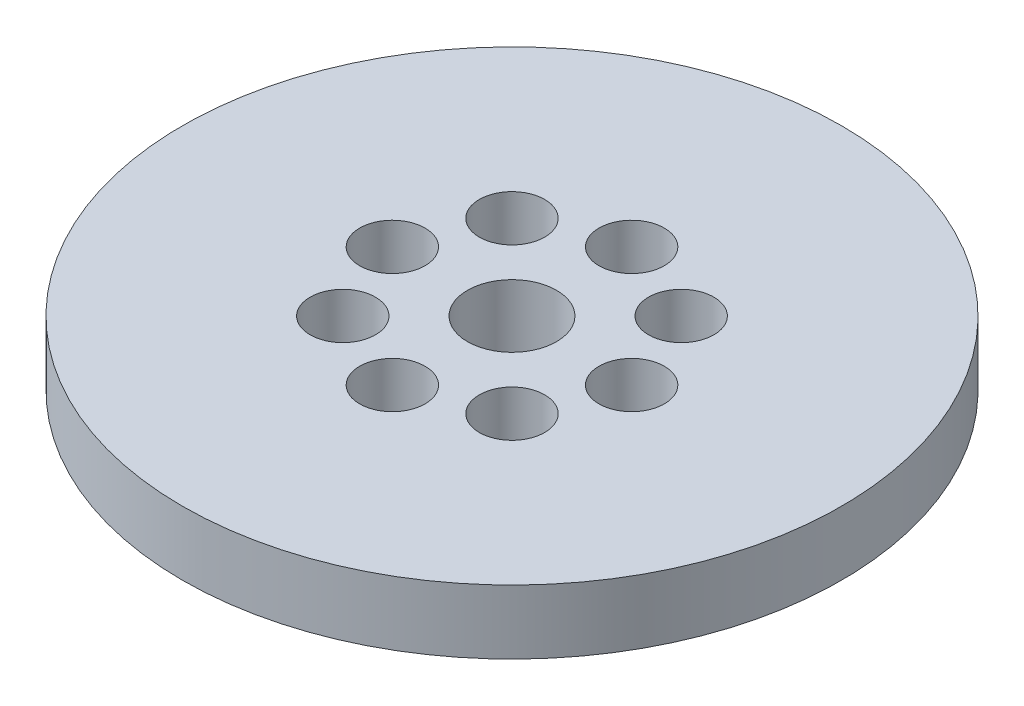
ISO-10303-21;
HEADER;
FILE_DESCRIPTION(('STEP AP214'),'2;1');
FILE_NAME('part.step','',(''),(''),'','','');
FILE_SCHEMA(('AUTOMOTIVE_DESIGN { 1 0 10303 214 1 1 1 1 }'));
ENDSEC;
DATA;
#1=APPLICATION_CONTEXT('core data for automotive mechanical design processes');
#2=APPLICATION_PROTOCOL_DEFINITION('international standard','automotive_design',2000,#1);
#3=PRODUCT_CONTEXT('',#1,'mechanical');
#4=PRODUCT('Part','Part','',(#3));
#5=PRODUCT_RELATED_PRODUCT_CATEGORY('part','',(#4));
#6=PRODUCT_DEFINITION_FORMATION('','',#4);
#7=PRODUCT_DEFINITION_CONTEXT('part definition',#1,'design');
#8=PRODUCT_DEFINITION('design','',#6,#7);
#9=PRODUCT_DEFINITION_SHAPE('','',#8);
#10=(LENGTH_UNIT() NAMED_UNIT(*) SI_UNIT(.MILLI.,.METRE.));
#11=(NAMED_UNIT(*) PLANE_ANGLE_UNIT() SI_UNIT($,.RADIAN.));
#12=(NAMED_UNIT(*) SI_UNIT($,.STERADIAN.) SOLID_ANGLE_UNIT());
#13=UNCERTAINTY_MEASURE_WITH_UNIT(LENGTH_MEASURE(1.E-05),#10,'distance_accuracy_value','');
#14=(GEOMETRIC_REPRESENTATION_CONTEXT(3) GLOBAL_UNCERTAINTY_ASSIGNED_CONTEXT((#13)) GLOBAL_UNIT_ASSIGNED_CONTEXT((#10,
#11,#12)) REPRESENTATION_CONTEXT('',''));
#15=CARTESIAN_POINT('',(0.,0.,0.));
#16=DIRECTION('',(0.,0.,1.));
#17=DIRECTION('',(1.,0.,0.));
#18=AXIS2_PLACEMENT_3D('',#15,#16,#17);
#19=CARTESIAN_POINT('',(0.,18.,0.));
#20=DIRECTION('',(0.,-1.,0.));
#21=DIRECTION('',(0.,0.,-1.));
#22=AXIS2_PLACEMENT_3D('',#19,#20,#21);
#23=CYLINDRICAL_SURFACE('',#22,92.5);
#24=CARTESIAN_POINT('',(0.,18.,0.));
#25=DIRECTION('',(0.,1.,0.));
#26=DIRECTION('',(0.,0.,1.));
#27=AXIS2_PLACEMENT_3D('',#24,#25,#26);
#28=CIRCLE('',#27,92.5);
#29=CARTESIAN_POINT('',(0.,18.,92.5));
#30=VERTEX_POINT('',#29);
#31=EDGE_CURVE('E10',#30,#30,#28,.T.);
#32=ORIENTED_EDGE('',*,*,#31,.F.);
#33=EDGE_LOOP('',(#32));
#34=FACE_BOUND('',#33,.T.);
#35=CARTESIAN_POINT('',(0.,0.,0.));
#36=DIRECTION('',(0.,1.,0.));
#37=DIRECTION('',(0.,0.,1.));
#38=AXIS2_PLACEMENT_3D('',#35,#36,#37);
#39=CIRCLE('',#38,92.5);
#40=CARTESIAN_POINT('',(0.,0.,92.5));
#41=VERTEX_POINT('',#40);
#42=EDGE_CURVE('E37',#41,#41,#39,.T.);
#43=ORIENTED_EDGE('',*,*,#42,.T.);
#44=EDGE_LOOP('',(#43));
#45=FACE_BOUND('',#44,.T.);
#46=ADVANCED_FACE('F40',(#34,#45),#23,.T.);
#47=CARTESIAN_POINT('',(0.,18.,0.));
#48=DIRECTION('',(0.,1.,0.));
#49=DIRECTION('',(0.,0.,1.));
#50=AXIS2_PLACEMENT_3D('',#47,#48,#49);
#51=PLANE('',#50);
#52=CARTESIAN_POINT('',(1.17248747538768E-13,18.,33.5813759719584));
#53=DIRECTION('',(0.,1.,0.));
#54=DIRECTION('',(1.,0.,0.));
#55=AXIS2_PLACEMENT_3D('',#52,#53,#54);
#56=CIRCLE('',#55,9.17293482669235);
#57=CARTESIAN_POINT('',(9.17293482669247,18.,33.5813759719584));
#58=VERTEX_POINT('',#57);
#59=EDGE_CURVE('E88',#58,#58,#56,.T.);
#60=ORIENTED_EDGE('',*,*,#59,.F.);
#61=EDGE_LOOP('',(#60));
#62=FACE_BOUND('',#61,.T.);
#63=CARTESIAN_POINT('',(23.7456186713469,18.,23.7456186713467));
#64=DIRECTION('',(0.,1.,0.));
#65=DIRECTION('',(0.707106781186544,0.,-0.707106781186551));
#66=AXIS2_PLACEMENT_3D('',#63,#64,#65);
#67=CIRCLE('',#66,9.17293482669235);
#68=CARTESIAN_POINT('',(30.2318630906833,18.,17.2593742520102));
#69=VERTEX_POINT('',#68);
#70=EDGE_CURVE('E79',#69,#69,#67,.T.);
#71=ORIENTED_EDGE('',*,*,#70,.F.);
#72=EDGE_LOOP('',(#71));
#73=FACE_BOUND('',#72,.T.);
#74=CARTESIAN_POINT('',(33.5813759719584,18.,0.));
#75=DIRECTION('',(0.,1.,0.));
#76=DIRECTION('',(0.,0.,-1.));
#77=AXIS2_PLACEMENT_3D('',#74,#75,#76);
#78=CIRCLE('',#77,9.17293482669235);
#79=CARTESIAN_POINT('',(33.5813759719584,18.,-9.17293482669235));
#80=VERTEX_POINT('',#79);
#81=EDGE_CURVE('E74',#80,#80,#78,.T.);
#82=ORIENTED_EDGE('',*,*,#81,.F.);
#83=EDGE_LOOP('',(#82));
#84=FACE_BOUND('',#83,.T.);
#85=CARTESIAN_POINT('',(23.7456186713466,18.,-23.745618671347));
#86=DIRECTION('',(0.,1.,0.));
#87=DIRECTION('',(-0.707106781186554,0.,-0.707106781186541));
#88=AXIS2_PLACEMENT_3D('',#85,#86,#87);
#89=CIRCLE('',#88,9.17293482669235);
#90=CARTESIAN_POINT('',(17.2593742520101,18.,-30.2318630906834));
#91=VERTEX_POINT('',#90);
#92=EDGE_CURVE('E70',#91,#91,#89,.T.);
#93=ORIENTED_EDGE('',*,*,#92,.F.);
#94=EDGE_LOOP('',(#93));
#95=FACE_BOUND('',#94,.T.);
#96=CARTESIAN_POINT('',(-3.51746242616304E-13,18.,-33.5813759719584));
#97=DIRECTION('',(0.,1.,0.));
#98=DIRECTION('',(-1.,0.,0.));
#99=AXIS2_PLACEMENT_3D('',#96,#97,#98);
#100=CIRCLE('',#99,9.17293482669235);
#101=CARTESIAN_POINT('',(-9.1729348266927,18.,-33.5813759719583));
#102=VERTEX_POINT('',#101);
#103=EDGE_CURVE('E100',#102,#102,#100,.T.);
#104=ORIENTED_EDGE('',*,*,#103,.F.);
#105=EDGE_LOOP('',(#104));
#106=FACE_BOUND('',#105,.T.);
#107=CARTESIAN_POINT('',(-23.7456186713471,18.,-23.7456186713465));
#108=DIRECTION('',(0.,1.,0.));
#109=DIRECTION('',(-0.707106781186539,0.,0.707106781186556));
#110=AXIS2_PLACEMENT_3D('',#107,#108,#109);
#111=CIRCLE('',#110,9.17293482669235);
#112=CARTESIAN_POINT('',(-30.2318630906834,18.,-17.25937425201));
#113=VERTEX_POINT('',#112);
#114=EDGE_CURVE('E93',#113,#113,#111,.T.);
#115=ORIENTED_EDGE('',*,*,#114,.F.);
#116=EDGE_LOOP('',(#115));
#117=FACE_BOUND('',#116,.T.);
#118=CARTESIAN_POINT('',(-23.7456186713468,18.,23.7456186713468));
#119=DIRECTION('',(0.,1.,0.));
#120=DIRECTION('',(0.707106781186549,0.,0.707106781186546));
#121=AXIS2_PLACEMENT_3D('',#118,#119,#120);
#122=CIRCLE('',#121,9.17293482669235);
#123=CARTESIAN_POINT('',(-17.2593742520103,18.,30.2318630906832));
#124=VERTEX_POINT('',#123);
#125=EDGE_CURVE('E61',#124,#124,#122,.T.);
#126=ORIENTED_EDGE('',*,*,#125,.F.);
#127=EDGE_LOOP('',(#126));
#128=FACE_BOUND('',#127,.T.);
#129=CARTESIAN_POINT('',(-33.5813759719584,18.,0.));
#130=DIRECTION('',(0.,1.,0.));
#131=DIRECTION('',(0.,0.,1.));
#132=AXIS2_PLACEMENT_3D('',#129,#130,#131);
#133=CIRCLE('',#132,9.17293482669235);
#134=CARTESIAN_POINT('',(-33.5813759719584,18.,9.17293482669235));
#135=VERTEX_POINT('',#134);
#136=EDGE_CURVE('E54',#135,#135,#133,.T.);
#137=ORIENTED_EDGE('',*,*,#136,.F.);
#138=EDGE_LOOP('',(#137));
#139=FACE_BOUND('',#138,.T.);
#140=CARTESIAN_POINT('',(0.,18.,0.));
#141=DIRECTION('',(0.,1.,0.));
#142=DIRECTION('',(0.,0.,1.));
#143=AXIS2_PLACEMENT_3D('',#140,#141,#142);
#144=CIRCLE('',#143,12.5);
#145=CARTESIAN_POINT('',(0.,18.,12.5));
#146=VERTEX_POINT('',#145);
#147=EDGE_CURVE('E50',#146,#146,#144,.T.);
#148=ORIENTED_EDGE('',*,*,#147,.F.);
#149=EDGE_LOOP('',(#148));
#150=FACE_BOUND('',#149,.T.);
#151=ORIENTED_EDGE('',*,*,#31,.T.);
#152=EDGE_LOOP('',(#151));
#153=FACE_BOUND('',#152,.T.);
#154=ADVANCED_FACE('F115',(#62,#73,#84,#95,#106,#117,#128,#139,#150,#153),#51,.T.);
#155=CARTESIAN_POINT('',(0.,0.,0.));
#156=DIRECTION('',(0.,1.,0.));
#157=DIRECTION('',(0.,0.,1.));
#158=AXIS2_PLACEMENT_3D('',#155,#156,#157);
#159=PLANE('',#158);
#160=CARTESIAN_POINT('',(0.,0.,0.));
#161=DIRECTION('',(0.,1.,0.));
#162=DIRECTION('',(0.,0.,1.));
#163=AXIS2_PLACEMENT_3D('',#160,#161,#162);
#164=CIRCLE('',#163,12.5);
#165=CARTESIAN_POINT('',(0.,0.,12.5));
#166=VERTEX_POINT('',#165);
#167=EDGE_CURVE('E47',#166,#166,#164,.T.);
#168=ORIENTED_EDGE('',*,*,#167,.T.);
#169=EDGE_LOOP('',(#168));
#170=FACE_BOUND('',#169,.T.);
#171=ORIENTED_EDGE('',*,*,#42,.F.);
#172=EDGE_LOOP('',(#171));
#173=FACE_BOUND('',#172,.T.);
#174=ADVANCED_FACE('F113',(#170,#173),#159,.F.);
#175=CARTESIAN_POINT('',(0.,18.,0.));
#176=DIRECTION('',(0.,-1.,0.));
#177=DIRECTION('',(0.,0.,-1.));
#178=AXIS2_PLACEMENT_3D('',#175,#176,#177);
#179=CYLINDRICAL_SURFACE('',#178,12.5);
#180=ORIENTED_EDGE('',*,*,#147,.T.);
#181=EDGE_LOOP('',(#180));
#182=FACE_BOUND('',#181,.T.);
#183=ORIENTED_EDGE('',*,*,#167,.F.);
#184=EDGE_LOOP('',(#183));
#185=FACE_BOUND('',#184,.T.);
#186=ADVANCED_FACE('F127',(#182,#185),#179,.F.);
#187=CARTESIAN_POINT('',(-33.5813759719584,0.478809629029006,0.));
#188=DIRECTION('',(0.,1.,0.));
#189=DIRECTION('',(0.,0.,1.));
#190=AXIS2_PLACEMENT_3D('',#187,#188,#189);
#191=CYLINDRICAL_SURFACE('',#190,9.17293482669235);
#192=CARTESIAN_POINT('',(-33.5813759719584,0.478809629029006,0.));
#193=DIRECTION('',(0.,1.,0.));
#194=DIRECTION('',(0.,0.,1.));
#195=AXIS2_PLACEMENT_3D('',#192,#193,#194);
#196=CIRCLE('',#195,9.17293482669235);
#197=CARTESIAN_POINT('',(-33.5813759719584,0.478809629029006,9.17293482669235));
#198=VERTEX_POINT('',#197);
#199=EDGE_CURVE('E55',#198,#198,#196,.T.);
#200=ORIENTED_EDGE('',*,*,#199,.F.);
#201=EDGE_LOOP('',(#200));
#202=FACE_BOUND('',#201,.T.);
#203=ORIENTED_EDGE('',*,*,#136,.T.);
#204=EDGE_LOOP('',(#203));
#205=FACE_BOUND('',#204,.T.);
#206=ADVANCED_FACE('F129',(#202,#205),#191,.F.);
#207=CARTESIAN_POINT('',(-33.5813759719584,0.478809629029006,0.));
#208=DIRECTION('',(0.,1.,0.));
#209=DIRECTION('',(0.,0.,1.));
#210=AXIS2_PLACEMENT_3D('',#207,#208,#209);
#211=PLANE('',#210);
#212=ORIENTED_EDGE('',*,*,#199,.T.);
#213=EDGE_LOOP('',(#212));
#214=FACE_BOUND('',#213,.T.);
#215=ADVANCED_FACE('F157',(#214),#211,.T.);
#216=CARTESIAN_POINT('',(-23.7456186713468,0.478809629029006,23.7456186713468));
#217=DIRECTION('',(0.,1.,0.));
#218=DIRECTION('',(0.,0.,1.));
#219=AXIS2_PLACEMENT_3D('',#216,#217,#218);
#220=CYLINDRICAL_SURFACE('',#219,9.17293482669235);
#221=CARTESIAN_POINT('',(-23.7456186713468,0.478809629029006,23.7456186713468));
#222=DIRECTION('',(0.,1.,0.));
#223=DIRECTION('',(0.707106781186549,0.,0.707106781186546));
#224=AXIS2_PLACEMENT_3D('',#221,#222,#223);
#225=CIRCLE('',#224,9.17293482669235);
#226=CARTESIAN_POINT('',(-17.2593742520103,0.478809629029006,30.2318630906832));
#227=VERTEX_POINT('',#226);
#228=EDGE_CURVE('E59',#227,#227,#225,.T.);
#229=ORIENTED_EDGE('',*,*,#228,.F.);
#230=EDGE_LOOP('',(#229));
#231=FACE_BOUND('',#230,.T.);
#232=ORIENTED_EDGE('',*,*,#125,.T.);
#233=EDGE_LOOP('',(#232));
#234=FACE_BOUND('',#233,.T.);
#235=ADVANCED_FACE('F170',(#231,#234),#220,.F.);
#236=CARTESIAN_POINT('',(-23.7456186713468,0.478809629029006,23.7456186713468));
#237=DIRECTION('',(0.,1.,0.));
#238=DIRECTION('',(0.707106781186549,0.,0.707106781186546));
#239=AXIS2_PLACEMENT_3D('',#236,#237,#238);
#240=PLANE('',#239);
#241=ORIENTED_EDGE('',*,*,#228,.T.);
#242=EDGE_LOOP('',(#241));
#243=FACE_BOUND('',#242,.T.);
#244=ADVANCED_FACE('F182',(#243),#240,.T.);
#245=CARTESIAN_POINT('',(-23.7456186713471,0.478809629029006,-23.7456186713465));
#246=DIRECTION('',(0.,1.,0.));
#247=DIRECTION('',(0.,0.,1.));
#248=AXIS2_PLACEMENT_3D('',#245,#246,#247);
#249=CYLINDRICAL_SURFACE('',#248,9.17293482669235);
#250=CARTESIAN_POINT('',(-23.7456186713471,0.478809629029006,-23.7456186713465));
#251=DIRECTION('',(0.,1.,0.));
#252=DIRECTION('',(-0.707106781186539,0.,0.707106781186556));
#253=AXIS2_PLACEMENT_3D('',#250,#251,#252);
#254=CIRCLE('',#253,9.17293482669235);
#255=CARTESIAN_POINT('',(-30.2318630906834,0.478809629029006,-17.25937425201));
#256=VERTEX_POINT('',#255);
#257=EDGE_CURVE('E94',#256,#256,#254,.T.);
#258=ORIENTED_EDGE('',*,*,#257,.F.);
#259=EDGE_LOOP('',(#258));
#260=FACE_BOUND('',#259,.T.);
#261=ORIENTED_EDGE('',*,*,#114,.T.);
#262=EDGE_LOOP('',(#261));
#263=FACE_BOUND('',#262,.T.);
#264=ADVANCED_FACE('F189',(#260,#263),#249,.F.);
#265=CARTESIAN_POINT('',(-23.7456186713471,0.478809629029006,-23.7456186713465));
#266=DIRECTION('',(0.,1.,0.));
#267=DIRECTION('',(-0.707106781186539,0.,0.707106781186556));
#268=AXIS2_PLACEMENT_3D('',#265,#266,#267);
#269=PLANE('',#268);
#270=ORIENTED_EDGE('',*,*,#257,.T.);
#271=EDGE_LOOP('',(#270));
#272=FACE_BOUND('',#271,.T.);
#273=ADVANCED_FACE('F107',(#272),#269,.T.);
#274=CARTESIAN_POINT('',(-3.51746242616304E-13,0.478809629029006,-33.5813759719584));
#275=DIRECTION('',(0.,1.,0.));
#276=DIRECTION('',(0.,0.,1.));
#277=AXIS2_PLACEMENT_3D('',#274,#275,#276);
#278=CYLINDRICAL_SURFACE('',#277,9.17293482669235);
#279=CARTESIAN_POINT('',(-3.51746242616304E-13,0.478809629029006,-33.5813759719584));
#280=DIRECTION('',(0.,1.,0.));
#281=DIRECTION('',(-1.,0.,0.));
#282=AXIS2_PLACEMENT_3D('',#279,#280,#281);
#283=CIRCLE('',#282,9.17293482669235);
#284=CARTESIAN_POINT('',(-9.1729348266927,0.478809629029006,-33.5813759719583));
#285=VERTEX_POINT('',#284);
#286=EDGE_CURVE('E72',#285,#285,#283,.T.);
#287=ORIENTED_EDGE('',*,*,#286,.F.);
#288=EDGE_LOOP('',(#287));
#289=FACE_BOUND('',#288,.T.);
#290=ORIENTED_EDGE('',*,*,#103,.T.);
#291=EDGE_LOOP('',(#290));
#292=FACE_BOUND('',#291,.T.);
#293=ADVANCED_FACE('F104',(#289,#292),#278,.F.);
#294=CARTESIAN_POINT('',(-3.51746242616304E-13,0.478809629029006,-33.5813759719584));
#295=DIRECTION('',(0.,1.,0.));
#296=DIRECTION('',(-1.,0.,0.));
#297=AXIS2_PLACEMENT_3D('',#294,#295,#296);
#298=PLANE('',#297);
#299=ORIENTED_EDGE('',*,*,#286,.T.);
#300=EDGE_LOOP('',(#299));
#301=FACE_BOUND('',#300,.T.);
#302=ADVANCED_FACE('F103',(#301),#298,.T.);
#303=CARTESIAN_POINT('',(23.7456186713466,0.478809629029006,-23.745618671347));
#304=DIRECTION('',(0.,1.,0.));
#305=DIRECTION('',(0.,0.,1.));
#306=AXIS2_PLACEMENT_3D('',#303,#304,#305);
#307=CYLINDRICAL_SURFACE('',#306,9.17293482669235);
#308=CARTESIAN_POINT('',(23.7456186713466,0.478809629029006,-23.745618671347));
#309=DIRECTION('',(0.,1.,0.));
#310=DIRECTION('',(-0.707106781186554,0.,-0.707106781186541));
#311=AXIS2_PLACEMENT_3D('',#308,#309,#310);
#312=CIRCLE('',#311,9.17293482669235);
#313=CARTESIAN_POINT('',(17.2593742520101,0.478809629029006,-30.2318630906834));
#314=VERTEX_POINT('',#313);
#315=EDGE_CURVE('E69',#314,#314,#312,.T.);
#316=ORIENTED_EDGE('',*,*,#315,.F.);
#317=EDGE_LOOP('',(#316));
#318=FACE_BOUND('',#317,.T.);
#319=ORIENTED_EDGE('',*,*,#92,.T.);
#320=EDGE_LOOP('',(#319));
#321=FACE_BOUND('',#320,.T.);
#322=ADVANCED_FACE('F219',(#318,#321),#307,.F.);
#323=CARTESIAN_POINT('',(23.7456186713466,0.478809629029006,-23.745618671347));
#324=DIRECTION('',(0.,1.,0.));
#325=DIRECTION('',(-0.707106781186554,0.,-0.707106781186541));
#326=AXIS2_PLACEMENT_3D('',#323,#324,#325);
#327=PLANE('',#326);
#328=ORIENTED_EDGE('',*,*,#315,.T.);
#329=EDGE_LOOP('',(#328));
#330=FACE_BOUND('',#329,.T.);
#331=ADVANCED_FACE('F227',(#330),#327,.T.);
#332=CARTESIAN_POINT('',(33.5813759719584,0.478809629029006,0.));
#333=DIRECTION('',(0.,1.,0.));
#334=DIRECTION('',(0.,0.,1.));
#335=AXIS2_PLACEMENT_3D('',#332,#333,#334);
#336=CYLINDRICAL_SURFACE('',#335,9.17293482669235);
#337=CARTESIAN_POINT('',(33.5813759719584,0.478809629029006,0.));
#338=DIRECTION('',(0.,1.,0.));
#339=DIRECTION('',(0.,0.,-1.));
#340=AXIS2_PLACEMENT_3D('',#337,#338,#339);
#341=CIRCLE('',#340,9.17293482669235);
#342=CARTESIAN_POINT('',(33.5813759719584,0.478809629029006,-9.17293482669235));
#343=VERTEX_POINT('',#342);
#344=EDGE_CURVE('E80',#343,#343,#341,.T.);
#345=ORIENTED_EDGE('',*,*,#344,.F.);
#346=EDGE_LOOP('',(#345));
#347=FACE_BOUND('',#346,.T.);
#348=ORIENTED_EDGE('',*,*,#81,.T.);
#349=EDGE_LOOP('',(#348));
#350=FACE_BOUND('',#349,.T.);
#351=ADVANCED_FACE('F240',(#347,#350),#336,.F.);
#352=CARTESIAN_POINT('',(33.5813759719584,0.478809629029006,0.));
#353=DIRECTION('',(0.,1.,0.));
#354=DIRECTION('',(0.,0.,-1.));
#355=AXIS2_PLACEMENT_3D('',#352,#353,#354);
#356=PLANE('',#355);
#357=ORIENTED_EDGE('',*,*,#344,.T.);
#358=EDGE_LOOP('',(#357));
#359=FACE_BOUND('',#358,.T.);
#360=ADVANCED_FACE('F246',(#359),#356,.T.);
#361=CARTESIAN_POINT('',(23.7456186713469,0.478809629029006,23.7456186713467));
#362=DIRECTION('',(0.,1.,0.));
#363=DIRECTION('',(0.,0.,1.));
#364=AXIS2_PLACEMENT_3D('',#361,#362,#363);
#365=CYLINDRICAL_SURFACE('',#364,9.17293482669235);
#366=CARTESIAN_POINT('',(23.7456186713469,0.478809629029006,23.7456186713467));
#367=DIRECTION('',(0.,1.,0.));
#368=DIRECTION('',(0.707106781186544,0.,-0.707106781186551));
#369=AXIS2_PLACEMENT_3D('',#366,#367,#368);
#370=CIRCLE('',#369,9.17293482669235);
#371=CARTESIAN_POINT('',(30.2318630906833,0.478809629029006,17.2593742520102));
#372=VERTEX_POINT('',#371);
#373=EDGE_CURVE('E82',#372,#372,#370,.T.);
#374=ORIENTED_EDGE('',*,*,#373,.F.);
#375=EDGE_LOOP('',(#374));
#376=FACE_BOUND('',#375,.T.);
#377=ORIENTED_EDGE('',*,*,#70,.T.);
#378=EDGE_LOOP('',(#377));
#379=FACE_BOUND('',#378,.T.);
#380=ADVANCED_FACE('F254',(#376,#379),#365,.F.);
#381=CARTESIAN_POINT('',(23.7456186713469,0.478809629029006,23.7456186713467));
#382=DIRECTION('',(0.,1.,0.));
#383=DIRECTION('',(0.707106781186544,0.,-0.707106781186551));
#384=AXIS2_PLACEMENT_3D('',#381,#382,#383);
#385=PLANE('',#384);
#386=ORIENTED_EDGE('',*,*,#373,.T.);
#387=EDGE_LOOP('',(#386));
#388=FACE_BOUND('',#387,.T.);
#389=ADVANCED_FACE('F262',(#388),#385,.T.);
#390=CARTESIAN_POINT('',(1.17248747538768E-13,0.478809629029006,33.5813759719584));
#391=DIRECTION('',(0.,1.,0.));
#392=DIRECTION('',(0.,0.,1.));
#393=AXIS2_PLACEMENT_3D('',#390,#391,#392);
#394=CYLINDRICAL_SURFACE('',#393,9.17293482669235);
#395=CARTESIAN_POINT('',(1.17248747538768E-13,0.478809629029006,33.5813759719584));
#396=DIRECTION('',(0.,1.,0.));
#397=DIRECTION('',(1.,0.,0.));
#398=AXIS2_PLACEMENT_3D('',#395,#396,#397);
#399=CIRCLE('',#398,9.17293482669235);
#400=CARTESIAN_POINT('',(9.17293482669247,0.478809629029006,33.5813759719584));
#401=VERTEX_POINT('',#400);
#402=EDGE_CURVE('E63',#401,#401,#399,.T.);
#403=ORIENTED_EDGE('',*,*,#402,.F.);
#404=EDGE_LOOP('',(#403));
#405=FACE_BOUND('',#404,.T.);
#406=ORIENTED_EDGE('',*,*,#59,.T.);
#407=EDGE_LOOP('',(#406));
#408=FACE_BOUND('',#407,.T.);
#409=ADVANCED_FACE('F272',(#405,#408),#394,.F.);
#410=CARTESIAN_POINT('',(1.17248747538768E-13,0.478809629029006,33.5813759719584));
#411=DIRECTION('',(0.,1.,0.));
#412=DIRECTION('',(1.,0.,0.));
#413=AXIS2_PLACEMENT_3D('',#410,#411,#412);
#414=PLANE('',#413);
#415=ORIENTED_EDGE('',*,*,#402,.T.);
#416=EDGE_LOOP('',(#415));
#417=FACE_BOUND('',#416,.T.);
#418=ADVANCED_FACE('F285',(#417),#414,.T.);
#419=CLOSED_SHELL('',(#46,#154,#174,#186,#206,#215,#235,#244,#264,#273,#293,#302,#322,#331,#351,
#360,#380,#389,#409,#418));
#420=MANIFOLD_SOLID_BREP('B2',#419);
#421=ADVANCED_BREP_SHAPE_REPRESENTATION('',(#18,#420),#14);
#422=SHAPE_DEFINITION_REPRESENTATION(#9,#421);
ENDSEC;
END-ISO-10303-21;
